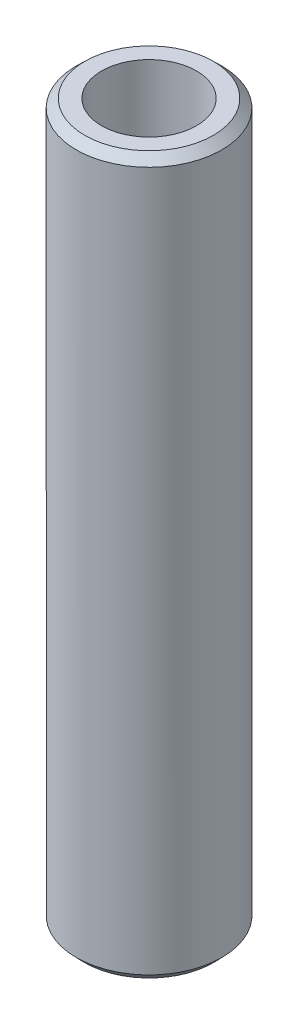
ISO-10303-21;
HEADER;
FILE_DESCRIPTION(('STEP AP214'),'2;1');
FILE_NAME('part.step','',(''),(''),'','','');
FILE_SCHEMA(('AUTOMOTIVE_DESIGN { 1 0 10303 214 1 1 1 1 }'));
ENDSEC;
DATA;
#1=APPLICATION_CONTEXT('core data for automotive mechanical design processes');
#2=APPLICATION_PROTOCOL_DEFINITION('international standard','automotive_design',2000,#1);
#3=PRODUCT_CONTEXT('',#1,'mechanical');
#4=PRODUCT('Part','Part','',(#3));
#5=PRODUCT_RELATED_PRODUCT_CATEGORY('part','',(#4));
#6=PRODUCT_DEFINITION_FORMATION('','',#4);
#7=PRODUCT_DEFINITION_CONTEXT('part definition',#1,'design');
#8=PRODUCT_DEFINITION('design','',#6,#7);
#9=PRODUCT_DEFINITION_SHAPE('','',#8);
#10=(LENGTH_UNIT() NAMED_UNIT(*) SI_UNIT(.MILLI.,.METRE.));
#11=(NAMED_UNIT(*) PLANE_ANGLE_UNIT() SI_UNIT($,.RADIAN.));
#12=(NAMED_UNIT(*) SI_UNIT($,.STERADIAN.) SOLID_ANGLE_UNIT());
#13=UNCERTAINTY_MEASURE_WITH_UNIT(LENGTH_MEASURE(1.E-05),#10,'distance_accuracy_value','');
#14=(GEOMETRIC_REPRESENTATION_CONTEXT(3) GLOBAL_UNCERTAINTY_ASSIGNED_CONTEXT((#13)) GLOBAL_UNIT_ASSIGNED_CONTEXT((#10,
#11,#12)) REPRESENTATION_CONTEXT('',''));
#15=CARTESIAN_POINT('',(0.,0.,0.));
#16=DIRECTION('',(0.,0.,1.));
#17=DIRECTION('',(1.,0.,0.));
#18=AXIS2_PLACEMENT_3D('',#15,#16,#17);
#19=CARTESIAN_POINT('',(0.,344.566195674987,0.));
#20=DIRECTION('',(0.,-1.,0.));
#21=DIRECTION('',(0.,0.,-1.));
#22=AXIS2_PLACEMENT_3D('',#19,#20,#21);
#23=CYLINDRICAL_SURFACE('',#22,35.);
#24=CARTESIAN_POINT('',(0.,340.576843704957,0.));
#25=DIRECTION('',(0.,1.,0.));
#26=DIRECTION('',(0.,0.,1.));
#27=AXIS2_PLACEMENT_3D('',#24,#25,#26);
#28=CIRCLE('',#27,35.);
#29=CARTESIAN_POINT('',(0.,340.576843704957,-35.));
#30=VERTEX_POINT('',#29);
#31=EDGE_CURVE('E50',#30,#30,#28,.F.);
#32=CARTESIAN_POINT('',(0.,4.10709163688244,0.));
#33=DIRECTION('',(0.,1.,0.));
#34=DIRECTION('',(0.,0.,1.));
#35=AXIS2_PLACEMENT_3D('',#32,#33,#34);
#36=CIRCLE('',#35,35.);
#37=CARTESIAN_POINT('',(0.,4.10709163688244,-35.));
#38=VERTEX_POINT('',#37);
#39=EDGE_CURVE('E51',#38,#38,#36,.T.);
#40=CARTESIAN_POINT('',(0.,340.576843704957,-35.));
#41=CARTESIAN_POINT('',(0.,337.071950454248,-35.));
#42=CARTESIAN_POINT('',(0.,333.567057203539,-35.));
#43=CARTESIAN_POINT('',(0.,326.557270702121,-35.));
#44=CARTESIAN_POINT('',(0.,323.052377451412,-35.));
#45=CARTESIAN_POINT('',(0.,316.042590949993,-35.));
#46=CARTESIAN_POINT('',(0.,312.537697699284,-35.));
#47=CARTESIAN_POINT('',(0.,305.527911197866,-35.));
#48=CARTESIAN_POINT('',(0.,302.023017947157,-35.));
#49=CARTESIAN_POINT('',(0.,295.013231445739,-35.));
#50=CARTESIAN_POINT('',(0.,291.50833819503,-35.));
#51=CARTESIAN_POINT('',(0.,284.498551693611,-35.));
#52=CARTESIAN_POINT('',(0.,280.993658442902,-35.));
#53=CARTESIAN_POINT('',(0.,273.983871941484,-35.));
#54=CARTESIAN_POINT('',(0.,270.478978690775,-35.));
#55=CARTESIAN_POINT('',(0.,263.469192189357,-35.));
#56=CARTESIAN_POINT('',(0.,259.964298938648,-35.));
#57=CARTESIAN_POINT('',(0.,252.954512437229,-35.));
#58=CARTESIAN_POINT('',(0.,249.44961918652,-35.));
#59=CARTESIAN_POINT('',(0.,242.439832685102,-35.));
#60=CARTESIAN_POINT('',(0.,238.934939434393,-35.));
#61=CARTESIAN_POINT('',(0.,231.925152932975,-35.));
#62=CARTESIAN_POINT('',(0.,228.420259682266,-35.));
#63=CARTESIAN_POINT('',(0.,221.410473180847,-35.));
#64=CARTESIAN_POINT('',(0.,217.905579930138,-35.));
#65=CARTESIAN_POINT('',(0.,210.89579342872,-35.));
#66=CARTESIAN_POINT('',(0.,207.390900178011,-35.));
#67=CARTESIAN_POINT('',(0.,200.381113676593,-35.));
#68=CARTESIAN_POINT('',(0.,196.876220425884,-35.));
#69=CARTESIAN_POINT('',(0.,189.866433924465,-35.));
#70=CARTESIAN_POINT('',(0.,186.361540673756,-35.));
#71=CARTESIAN_POINT('',(0.,179.351754172338,-35.));
#72=CARTESIAN_POINT('',(0.,175.846860921629,-35.));
#73=CARTESIAN_POINT('',(0.,168.837074420211,-35.));
#74=CARTESIAN_POINT('',(0.,165.332181169502,-35.));
#75=CARTESIAN_POINT('',(0.,158.322394668083,-35.));
#76=CARTESIAN_POINT('',(0.,154.817501417374,-35.));
#77=CARTESIAN_POINT('',(0.,147.807714915956,-35.));
#78=CARTESIAN_POINT('',(0.,144.302821665247,-35.));
#79=CARTESIAN_POINT('',(0.,137.293035163829,-35.));
#80=CARTESIAN_POINT('',(0.,133.78814191312,-35.));
#81=CARTESIAN_POINT('',(0.,126.778355411701,-35.));
#82=CARTESIAN_POINT('',(0.,123.273462160992,-35.));
#83=CARTESIAN_POINT('',(0.,116.263675659574,-35.));
#84=CARTESIAN_POINT('',(0.,112.758782408865,-35.));
#85=CARTESIAN_POINT('',(0.,105.748995907447,-35.));
#86=CARTESIAN_POINT('',(0.,102.244102656738,-35.));
#87=CARTESIAN_POINT('',(0.,95.2343161553193,-35.));
#88=CARTESIAN_POINT('',(0.,91.7294229046102,-35.));
#89=CARTESIAN_POINT('',(0.,84.719636403192,-35.));
#90=CARTESIAN_POINT('',(0.,81.2147431524829,-35.));
#91=CARTESIAN_POINT('',(0.,74.2049566510647,-35.));
#92=CARTESIAN_POINT('',(0.,70.7000634003556,-35.));
#93=CARTESIAN_POINT('',(0.,63.6902768989373,-35.));
#94=CARTESIAN_POINT('',(0.,60.1853836482283,-35.));
#95=CARTESIAN_POINT('',(0.,53.17559714681,-35.));
#96=CARTESIAN_POINT('',(0.,49.6707038961009,-35.));
#97=CARTESIAN_POINT('',(0.,42.6609173946827,-35.));
#98=CARTESIAN_POINT('',(0.,39.1560241439736,-35.));
#99=CARTESIAN_POINT('',(0.,32.1462376425554,-35.));
#100=CARTESIAN_POINT('',(0.,28.6413443918462,-35.));
#101=CARTESIAN_POINT('',(0.,21.631557890428,-35.));
#102=CARTESIAN_POINT('',(0.,18.1266646397189,-35.));
#103=CARTESIAN_POINT('',(0.,11.1168781383007,-35.));
#104=CARTESIAN_POINT('',(0.,7.61198488759157,-35.));
#105=CARTESIAN_POINT('',(0.,4.10709163688244,-35.));
#106=B_SPLINE_CURVE_WITH_KNOTS('',3,(#40,#41,#42,#43,#44,#45,#46,#47,#48,#49,#50,#51,#52,#53,
#54,#55,#56,#57,#58,#59,#60,#61,#62,#63,#64,#65,#66,#67,#68,#69,#70,#71,#72,#73,#74,#75,#76,#77,
#78,#79,#80,#81,#82,#83,#84,#85,#86,#87,#88,#89,#90,#91,#92,#93,#94,#95,#96,#97,#98,#99,#100,
#101,#102,#103,#104,#105),.UNSPECIFIED.,.F.,.F.,(4,2,2,2,2,2,2,2,2,2,2,2,2,2,2,2,2,2,2,2,2,2,2,
2,2,2,2,2,2,2,2,2,4),(0.,10.5146797521273,21.0293595042547,31.544039256382,42.0587190085093,
52.5733987606367,63.088078512764,73.6027582648913,84.1174380170187,94.632117769146,
105.146797521273,115.661477273401,126.176157025528,136.690836777655,147.205516529783,
157.72019628191,168.234876034037,178.749555786165,189.264235538292,199.778915290419,
210.293595042547,220.808274794674,231.322954546801,241.837634298929,252.352314051056,
262.866993803183,273.381673555311,283.896353307438,294.411033059565,304.925712811693,
315.44039256382,325.955072315947,336.469752068075),.UNSPECIFIED.);
#107=EDGE_CURVE('BSEAM39',#30,#38,#106,.T.);
#108=ORIENTED_EDGE('',*,*,#31,.T.);
#109=ORIENTED_EDGE('',*,*,#39,.T.);
#110=ORIENTED_EDGE('',*,*,#107,.T.);
#111=ORIENTED_EDGE('',*,*,#107,.F.);
#112=EDGE_LOOP('',(#108,#110,#109,#111));
#113=FACE_BOUND('',#112,.T.);
#114=ADVANCED_FACE('F39',(#113),#23,.T.);
#115=CARTESIAN_POINT('',(0.,344.566195674987,0.));
#116=DIRECTION('',(0.,1.,0.));
#117=DIRECTION('',(0.,0.,1.));
#118=AXIS2_PLACEMENT_3D('',#115,#116,#117);
#119=PLANE('',#118);
#120=CARTESIAN_POINT('',(0.,344.566195674987,0.));
#121=DIRECTION('',(0.,1.,0.));
#122=DIRECTION('',(0.,0.,1.));
#123=AXIS2_PLACEMENT_3D('',#120,#121,#122);
#124=CIRCLE('',#123,30.892908363118);
#125=CARTESIAN_POINT('',(0.,344.566195674987,30.892908363118));
#126=VERTEX_POINT('',#125);
#127=EDGE_CURVE('E54',#126,#126,#124,.T.);
#128=ORIENTED_EDGE('',*,*,#127,.T.);
#129=EDGE_LOOP('',(#128));
#130=FACE_BOUND('',#129,.T.);
#131=CARTESIAN_POINT('',(0.,344.566195674987,0.));
#132=DIRECTION('',(0.,1.,0.));
#133=DIRECTION('',(0.,0.,1.));
#134=AXIS2_PLACEMENT_3D('',#131,#132,#133);
#135=CIRCLE('',#134,22.8427712000509);
#136=CARTESIAN_POINT('',(0.,344.566195674987,-22.8427712000509));
#137=VERTEX_POINT('',#136);
#138=EDGE_CURVE('E58',#137,#137,#135,.T.);
#139=ORIENTED_EDGE('',*,*,#138,.F.);
#140=EDGE_LOOP('',(#139));
#141=FACE_BOUND('',#140,.T.);
#142=ADVANCED_FACE('F69',(#130,#141),#119,.T.);
#143=CARTESIAN_POINT('',(0.,0.,0.));
#144=DIRECTION('',(0.,1.,0.));
#145=DIRECTION('',(0.,0.,1.));
#146=AXIS2_PLACEMENT_3D('',#143,#144,#145);
#147=PLANE('',#146);
#148=CARTESIAN_POINT('',(0.,0.,0.));
#149=DIRECTION('',(0.,1.,0.));
#150=DIRECTION('',(0.,0.,1.));
#151=AXIS2_PLACEMENT_3D('',#148,#149,#150);
#152=CIRCLE('',#151,31.0106480299699);
#153=CARTESIAN_POINT('',(0.,0.,31.0106480299699));
#154=VERTEX_POINT('',#153);
#155=EDGE_CURVE('E10',#154,#154,#152,.F.);
#156=ORIENTED_EDGE('',*,*,#155,.T.);
#157=EDGE_LOOP('',(#156));
#158=FACE_BOUND('',#157,.T.);
#159=CARTESIAN_POINT('',(0.,0.,0.));
#160=DIRECTION('',(0.,1.,0.));
#161=DIRECTION('',(0.,0.,1.));
#162=AXIS2_PLACEMENT_3D('',#159,#160,#161);
#163=CIRCLE('',#162,22.8427712000509);
#164=CARTESIAN_POINT('',(0.,0.,-22.8427712000509));
#165=VERTEX_POINT('',#164);
#166=EDGE_CURVE('E63',#165,#165,#163,.T.);
#167=ORIENTED_EDGE('',*,*,#166,.T.);
#168=EDGE_LOOP('',(#167));
#169=FACE_BOUND('',#168,.T.);
#170=ADVANCED_FACE('F75',(#158,#169),#147,.F.);
#171=CARTESIAN_POINT('',(0.,344.566195674987,0.));
#172=DIRECTION('',(0.,-1.,0.));
#173=DIRECTION('',(0.,0.,-1.));
#174=AXIS2_PLACEMENT_3D('',#171,#172,#173);
#175=CYLINDRICAL_SURFACE('',#174,22.8427712000509);
#176=CARTESIAN_POINT('',(0.,344.566195674987,-22.8427712000509));
#177=CARTESIAN_POINT('',(0.,340.976964470039,-22.8427712000509));
#178=CARTESIAN_POINT('',(0.,337.387733265091,-22.8427712000509));
#179=CARTESIAN_POINT('',(0.,330.209270855196,-22.8427712000509));
#180=CARTESIAN_POINT('',(0.,326.620039650248,-22.8427712000509));
#181=CARTESIAN_POINT('',(0.,319.441577240352,-22.8427712000509));
#182=CARTESIAN_POINT('',(0.,315.852346035404,-22.8427712000509));
#183=CARTESIAN_POINT('',(0.,308.673883625509,-22.8427712000509));
#184=CARTESIAN_POINT('',(0.,305.084652420561,-22.8427712000509));
#185=CARTESIAN_POINT('',(0.,297.906190010666,-22.8427712000509));
#186=CARTESIAN_POINT('',(0.,294.316958805718,-22.8427712000509));
#187=CARTESIAN_POINT('',(0.,287.138496395822,-22.8427712000509));
#188=CARTESIAN_POINT('',(0.,283.549265190874,-22.8427712000509));
#189=CARTESIAN_POINT('',(0.,276.370802780979,-22.8427712000509));
#190=CARTESIAN_POINT('',(0.,272.781571576031,-22.8427712000509));
#191=CARTESIAN_POINT('',(0.,265.603109166136,-22.8427712000509));
#192=CARTESIAN_POINT('',(0.,262.013877961188,-22.8427712000509));
#193=CARTESIAN_POINT('',(0.,254.835415551292,-22.8427712000509));
#194=CARTESIAN_POINT('',(0.,251.246184346344,-22.8427712000509));
#195=CARTESIAN_POINT('',(0.,244.067721936449,-22.8427712000509));
#196=CARTESIAN_POINT('',(0.,240.478490731501,-22.8427712000509));
#197=CARTESIAN_POINT('',(0.,233.300028321606,-22.8427712000509));
#198=CARTESIAN_POINT('',(0.,229.710797116658,-22.8427712000509));
#199=CARTESIAN_POINT('',(0.,222.532334706762,-22.8427712000509));
#200=CARTESIAN_POINT('',(0.,218.943103501814,-22.8427712000509));
#201=CARTESIAN_POINT('',(0.,211.764641091919,-22.8427712000509));
#202=CARTESIAN_POINT('',(0.,208.175409886971,-22.8427712000509));
#203=CARTESIAN_POINT('',(0.,200.996947477076,-22.8427712000509));
#204=CARTESIAN_POINT('',(0.,197.407716272128,-22.8427712000509));
#205=CARTESIAN_POINT('',(0.,190.229253862232,-22.8427712000509));
#206=CARTESIAN_POINT('',(0.,186.640022657284,-22.8427712000509));
#207=CARTESIAN_POINT('',(0.,179.461560247389,-22.8427712000509));
#208=CARTESIAN_POINT('',(0.,175.872329042441,-22.8427712000509));
#209=CARTESIAN_POINT('',(0.,168.693866632546,-22.8427712000509));
#210=CARTESIAN_POINT('',(0.,165.104635427598,-22.8427712000509));
#211=CARTESIAN_POINT('',(0.,157.926173017702,-22.8427712000509));
#212=CARTESIAN_POINT('',(0.,154.336941812754,-22.8427712000509));
#213=CARTESIAN_POINT('',(0.,147.158479402859,-22.8427712000509));
#214=CARTESIAN_POINT('',(0.,143.569248197911,-22.8427712000509));
#215=CARTESIAN_POINT('',(0.,136.390785788016,-22.8427712000509));
#216=CARTESIAN_POINT('',(0.,132.801554583068,-22.8427712000509));
#217=CARTESIAN_POINT('',(0.,125.623092173172,-22.8427712000509));
#218=CARTESIAN_POINT('',(0.,122.033860968224,-22.8427712000509));
#219=CARTESIAN_POINT('',(0.,114.855398558329,-22.8427712000509));
#220=CARTESIAN_POINT('',(0.,111.266167353381,-22.8427712000509));
#221=CARTESIAN_POINT('',(0.,104.087704943485,-22.8427712000509));
#222=CARTESIAN_POINT('',(0.,100.498473738538,-22.8427712000509));
#223=CARTESIAN_POINT('',(0.,93.3200113286422,-22.8427712000509));
#224=CARTESIAN_POINT('',(0.,89.7307801236944,-22.8427712000509));
#225=CARTESIAN_POINT('',(0.,82.5523177137989,-22.8427712000509));
#226=CARTESIAN_POINT('',(0.,78.9630865088511,-22.8427712000509));
#227=CARTESIAN_POINT('',(0.,71.7846240989555,-22.8427712000509));
#228=CARTESIAN_POINT('',(0.,68.1953928940078,-22.8427712000509));
#229=CARTESIAN_POINT('',(0.,61.0169304841122,-22.8427712000509));
#230=CARTESIAN_POINT('',(0.,57.4276992791644,-22.8427712000509));
#231=CARTESIAN_POINT('',(0.,50.2492368692688,-22.8427712000509));
#232=CARTESIAN_POINT('',(0.,46.6600056643211,-22.8427712000509));
#233=CARTESIAN_POINT('',(0.,39.4815432544255,-22.8427712000509));
#234=CARTESIAN_POINT('',(0.,35.8923120494778,-22.8427712000509));
#235=CARTESIAN_POINT('',(0.,28.7138496395822,-22.8427712000509));
#236=CARTESIAN_POINT('',(0.,25.1246184346344,-22.8427712000509));
#237=CARTESIAN_POINT('',(0.,17.9461560247388,-22.8427712000509));
#238=CARTESIAN_POINT('',(0.,14.356924819791,-22.8427712000509));
#239=CARTESIAN_POINT('',(0.,7.17846240989549,-22.8427712000509));
#240=CARTESIAN_POINT('',(0.,3.58923120494772,-22.8427712000509));
#241=CARTESIAN_POINT('',(0.,0.,-22.8427712000509));
#242=B_SPLINE_CURVE_WITH_KNOTS('',3,(#176,#177,#178,#179,#180,#181,#182,#183,#184,#185,#186,
#187,#188,#189,#190,#191,#192,#193,#194,#195,#196,#197,#198,#199,#200,#201,#202,#203,#204,#205,
#206,#207,#208,#209,#210,#211,#212,#213,#214,#215,#216,#217,#218,#219,#220,#221,#222,#223,#224,
#225,#226,#227,#228,#229,#230,#231,#232,#233,#234,#235,#236,#237,#238,#239,#240,#241),
.UNSPECIFIED.,.F.,.F.,(4,2,2,2,2,2,2,2,2,2,2,2,2,2,2,2,2,2,2,2,2,2,2,2,2,2,2,2,2,2,2,2,4),(0.,
10.7676936148434,21.5353872296867,32.30308084453,43.0707744593734,53.8384680742167,
64.60616168906,75.3738553039034,86.1415489187467,96.9092425335901,107.676936148433,
118.444629763277,129.21232337812,139.980016992963,150.747710607807,161.51540422265,
172.283097837493,183.050791452337,193.81848506718,204.586178682023,215.353872296867,
226.12156591171,236.889259526553,247.656953141397,258.42464675624,269.192340371083,
279.960033985927,290.72772760077,301.495421215613,312.263114830457,323.0308084453,
333.798502060143,344.566195674987),.UNSPECIFIED.);
#243=EDGE_CURVE('BSEAM70',#137,#165,#242,.T.);
#244=ORIENTED_EDGE('',*,*,#138,.T.);
#245=ORIENTED_EDGE('',*,*,#166,.F.);
#246=ORIENTED_EDGE('',*,*,#243,.T.);
#247=ORIENTED_EDGE('',*,*,#243,.F.);
#248=EDGE_LOOP('',(#244,#246,#245,#247));
#249=FACE_BOUND('',#248,.T.);
#250=ADVANCED_FACE('F70',(#249),#175,.F.);
#251=CARTESIAN_POINT('',(0.,344.566195674987,0.));
#252=DIRECTION('',(0.,-1.,0.));
#253=DIRECTION('',(0.,0.,-1.));
#254=AXIS2_PLACEMENT_3D('',#251,#252,#253);
#255=CONICAL_SURFACE('',#254,30.892908363118,0.799939284659382);
#256=ORIENTED_EDGE('',*,*,#31,.F.);
#257=EDGE_LOOP('',(#256));
#258=FACE_BOUND('',#257,.T.);
#259=ORIENTED_EDGE('',*,*,#127,.F.);
#260=EDGE_LOOP('',(#259));
#261=FACE_BOUND('',#260,.T.);
#262=ADVANCED_FACE('F81',(#258,#261),#255,.T.);
#263=CARTESIAN_POINT('',(0.,4.10709163688244,0.));
#264=DIRECTION('',(0.,1.,0.));
#265=DIRECTION('',(0.,0.,1.));
#266=AXIS2_PLACEMENT_3D('',#263,#264,#265);
#267=CONICAL_SURFACE('',#266,35.,0.770857042135516);
#268=ORIENTED_EDGE('',*,*,#155,.F.);
#269=EDGE_LOOP('',(#268));
#270=FACE_BOUND('',#269,.T.);
#271=ORIENTED_EDGE('',*,*,#39,.F.);
#272=EDGE_LOOP('',(#271));
#273=FACE_BOUND('',#272,.T.);
#274=ADVANCED_FACE('F45',(#270,#273),#267,.T.);
#275=CLOSED_SHELL('',(#114,#142,#170,#250,#262,#274));
#276=MANIFOLD_SOLID_BREP('B2',#275);
#277=ADVANCED_BREP_SHAPE_REPRESENTATION('',(#18,#276),#14);
#278=SHAPE_DEFINITION_REPRESENTATION(#9,#277);
ENDSEC;
END-ISO-10303-21;
